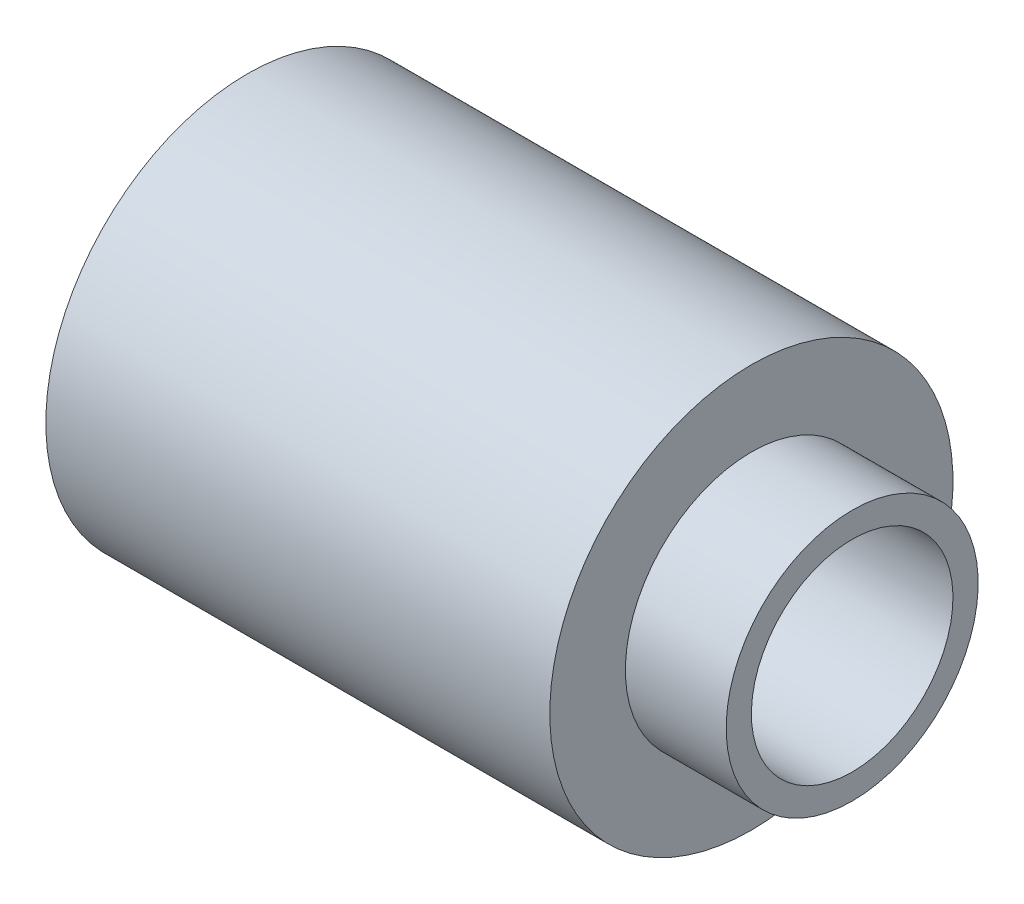
ISO-10303-21;
HEADER;
FILE_DESCRIPTION(('STEP AP214'),'2;1');
FILE_NAME('part.step','',(''),(''),'','','');
FILE_SCHEMA(('AUTOMOTIVE_DESIGN { 1 0 10303 214 1 1 1 1 }'));
ENDSEC;
DATA;
#1=APPLICATION_CONTEXT('core data for automotive mechanical design processes');
#2=APPLICATION_PROTOCOL_DEFINITION('international standard','automotive_design',2000,#1);
#3=PRODUCT_CONTEXT('',#1,'mechanical');
#4=PRODUCT('Part','Part','',(#3));
#5=PRODUCT_RELATED_PRODUCT_CATEGORY('part','',(#4));
#6=PRODUCT_DEFINITION_FORMATION('','',#4);
#7=PRODUCT_DEFINITION_CONTEXT('part definition',#1,'design');
#8=PRODUCT_DEFINITION('design','',#6,#7);
#9=PRODUCT_DEFINITION_SHAPE('','',#8);
#10=(LENGTH_UNIT() NAMED_UNIT(*) SI_UNIT(.MILLI.,.METRE.));
#11=(NAMED_UNIT(*) PLANE_ANGLE_UNIT() SI_UNIT($,.RADIAN.));
#12=(NAMED_UNIT(*) SI_UNIT($,.STERADIAN.) SOLID_ANGLE_UNIT());
#13=UNCERTAINTY_MEASURE_WITH_UNIT(LENGTH_MEASURE(1.E-05),#10,'distance_accuracy_value','');
#14=(GEOMETRIC_REPRESENTATION_CONTEXT(3) GLOBAL_UNCERTAINTY_ASSIGNED_CONTEXT((#13)) GLOBAL_UNIT_ASSIGNED_CONTEXT((#10,
#11,#12)) REPRESENTATION_CONTEXT('',''));
#15=CARTESIAN_POINT('',(0.,0.,0.));
#16=DIRECTION('',(0.,0.,1.));
#17=DIRECTION('',(1.,0.,0.));
#18=AXIS2_PLACEMENT_3D('',#15,#16,#17);
#19=CARTESIAN_POINT('',(-6.1942396942397,0.,0.));
#20=DIRECTION('',(-1.,0.,0.));
#21=DIRECTION('',(0.,-1.,0.));
#22=AXIS2_PLACEMENT_3D('',#19,#20,#21);
#23=CYLINDRICAL_SURFACE('',#22,2.);
#24=CARTESIAN_POINT('',(7.62394212394212,0.,0.));
#25=DIRECTION('',(-1.,0.,0.));
#26=DIRECTION('',(0.,-1.,0.));
#27=AXIS2_PLACEMENT_3D('',#24,#25,#26);
#28=CIRCLE('',#27,2.);
#29=CARTESIAN_POINT('',(7.62394212394212,-2.,0.));
#30=VERTEX_POINT('',#29);
#31=EDGE_CURVE('E53',#30,#30,#28,.T.);
#32=ORIENTED_EDGE('',*,*,#31,.F.);
#33=EDGE_LOOP('',(#32));
#34=FACE_BOUND('',#33,.T.);
#35=CARTESIAN_POINT('',(-4.37605787605788,0.,0.));
#36=DIRECTION('',(-1.,0.,0.));
#37=DIRECTION('',(0.,-1.,0.));
#38=AXIS2_PLACEMENT_3D('',#35,#36,#37);
#39=CIRCLE('',#38,2.);
#40=CARTESIAN_POINT('',(-4.37605787605788,-2.,0.));
#41=VERTEX_POINT('',#40);
#42=EDGE_CURVE('E10',#41,#41,#39,.T.);
#43=ORIENTED_EDGE('',*,*,#42,.T.);
#44=EDGE_LOOP('',(#43));
#45=FACE_BOUND('',#44,.T.);
#46=ADVANCED_FACE('F31',(#34,#45),#23,.F.);
#47=CARTESIAN_POINT('',(-4.37605787605788,2.,0.));
#48=DIRECTION('',(1.,0.,0.));
#49=DIRECTION('',(0.,1.,0.));
#50=AXIS2_PLACEMENT_3D('',#47,#48,#49);
#51=PLANE('',#50);
#52=ORIENTED_EDGE('',*,*,#42,.F.);
#53=EDGE_LOOP('',(#52));
#54=FACE_BOUND('',#53,.T.);
#55=CARTESIAN_POINT('',(-4.37605787605788,0.,0.));
#56=DIRECTION('',(-1.,0.,0.));
#57=DIRECTION('',(0.,-1.,0.));
#58=AXIS2_PLACEMENT_3D('',#55,#56,#57);
#59=CIRCLE('',#58,4.);
#60=CARTESIAN_POINT('',(-4.37605787605788,-4.,0.));
#61=VERTEX_POINT('',#60);
#62=EDGE_CURVE('E37',#61,#61,#59,.T.);
#63=ORIENTED_EDGE('',*,*,#62,.T.);
#64=EDGE_LOOP('',(#63));
#65=FACE_BOUND('',#64,.T.);
#66=ADVANCED_FACE('F60',(#54,#65),#51,.F.);
#67=CARTESIAN_POINT('',(-6.1942396942397,0.,0.));
#68=DIRECTION('',(-1.,0.,0.));
#69=DIRECTION('',(0.,-1.,0.));
#70=AXIS2_PLACEMENT_3D('',#67,#68,#69);
#71=CYLINDRICAL_SURFACE('',#70,4.);
#72=ORIENTED_EDGE('',*,*,#62,.F.);
#73=EDGE_LOOP('',(#72));
#74=FACE_BOUND('',#73,.T.);
#75=CARTESIAN_POINT('',(5.62394212394212,0.,0.));
#76=DIRECTION('',(-1.,0.,0.));
#77=DIRECTION('',(0.,-1.,0.));
#78=AXIS2_PLACEMENT_3D('',#75,#76,#77);
#79=CIRCLE('',#78,4.);
#80=CARTESIAN_POINT('',(5.62394212394212,-4.,0.));
#81=VERTEX_POINT('',#80);
#82=EDGE_CURVE('E41',#81,#81,#79,.T.);
#83=ORIENTED_EDGE('',*,*,#82,.T.);
#84=EDGE_LOOP('',(#83));
#85=FACE_BOUND('',#84,.T.);
#86=ADVANCED_FACE('F64',(#74,#85),#71,.T.);
#87=CARTESIAN_POINT('',(5.62394212394212,4.,0.));
#88=DIRECTION('',(-1.,0.,0.));
#89=DIRECTION('',(0.,-1.,0.));
#90=AXIS2_PLACEMENT_3D('',#87,#88,#89);
#91=PLANE('',#90);
#92=ORIENTED_EDGE('',*,*,#82,.F.);
#93=EDGE_LOOP('',(#92));
#94=FACE_BOUND('',#93,.T.);
#95=CARTESIAN_POINT('',(5.62394212394212,0.,0.));
#96=DIRECTION('',(-1.,0.,0.));
#97=DIRECTION('',(0.,-1.,0.));
#98=AXIS2_PLACEMENT_3D('',#95,#96,#97);
#99=CIRCLE('',#98,2.5);
#100=CARTESIAN_POINT('',(5.62394212394212,-2.5,0.));
#101=VERTEX_POINT('',#100);
#102=EDGE_CURVE('E45',#101,#101,#99,.T.);
#103=ORIENTED_EDGE('',*,*,#102,.T.);
#104=EDGE_LOOP('',(#103));
#105=FACE_BOUND('',#104,.T.);
#106=ADVANCED_FACE('F69',(#94,#105),#91,.F.);
#107=CARTESIAN_POINT('',(-6.1942396942397,0.,0.));
#108=DIRECTION('',(-1.,0.,0.));
#109=DIRECTION('',(0.,-1.,0.));
#110=AXIS2_PLACEMENT_3D('',#107,#108,#109);
#111=CYLINDRICAL_SURFACE('',#110,2.5);
#112=ORIENTED_EDGE('',*,*,#102,.F.);
#113=EDGE_LOOP('',(#112));
#114=FACE_BOUND('',#113,.T.);
#115=CARTESIAN_POINT('',(7.62394212394212,0.,0.));
#116=DIRECTION('',(-1.,0.,0.));
#117=DIRECTION('',(0.,-1.,0.));
#118=AXIS2_PLACEMENT_3D('',#115,#116,#117);
#119=CIRCLE('',#118,2.5);
#120=CARTESIAN_POINT('',(7.62394212394212,-2.5,0.));
#121=VERTEX_POINT('',#120);
#122=EDGE_CURVE('E50',#121,#121,#119,.T.);
#123=ORIENTED_EDGE('',*,*,#122,.T.);
#124=EDGE_LOOP('',(#123));
#125=FACE_BOUND('',#124,.T.);
#126=ADVANCED_FACE('F75',(#114,#125),#111,.T.);
#127=CARTESIAN_POINT('',(7.62394212394212,2.5,0.));
#128=DIRECTION('',(-1.,0.,0.));
#129=DIRECTION('',(0.,-1.,0.));
#130=AXIS2_PLACEMENT_3D('',#127,#128,#129);
#131=PLANE('',#130);
#132=ORIENTED_EDGE('',*,*,#122,.F.);
#133=EDGE_LOOP('',(#132));
#134=FACE_BOUND('',#133,.T.);
#135=ORIENTED_EDGE('',*,*,#31,.T.);
#136=EDGE_LOOP('',(#135));
#137=FACE_BOUND('',#136,.T.);
#138=ADVANCED_FACE('F57',(#134,#137),#131,.F.);
#139=CLOSED_SHELL('',(#46,#66,#86,#106,#126,#138));
#140=MANIFOLD_SOLID_BREP('B2',#139);
#141=ADVANCED_BREP_SHAPE_REPRESENTATION('',(#18,#140),#14);
#142=SHAPE_DEFINITION_REPRESENTATION(#9,#141);
ENDSEC;
END-ISO-10303-21;
